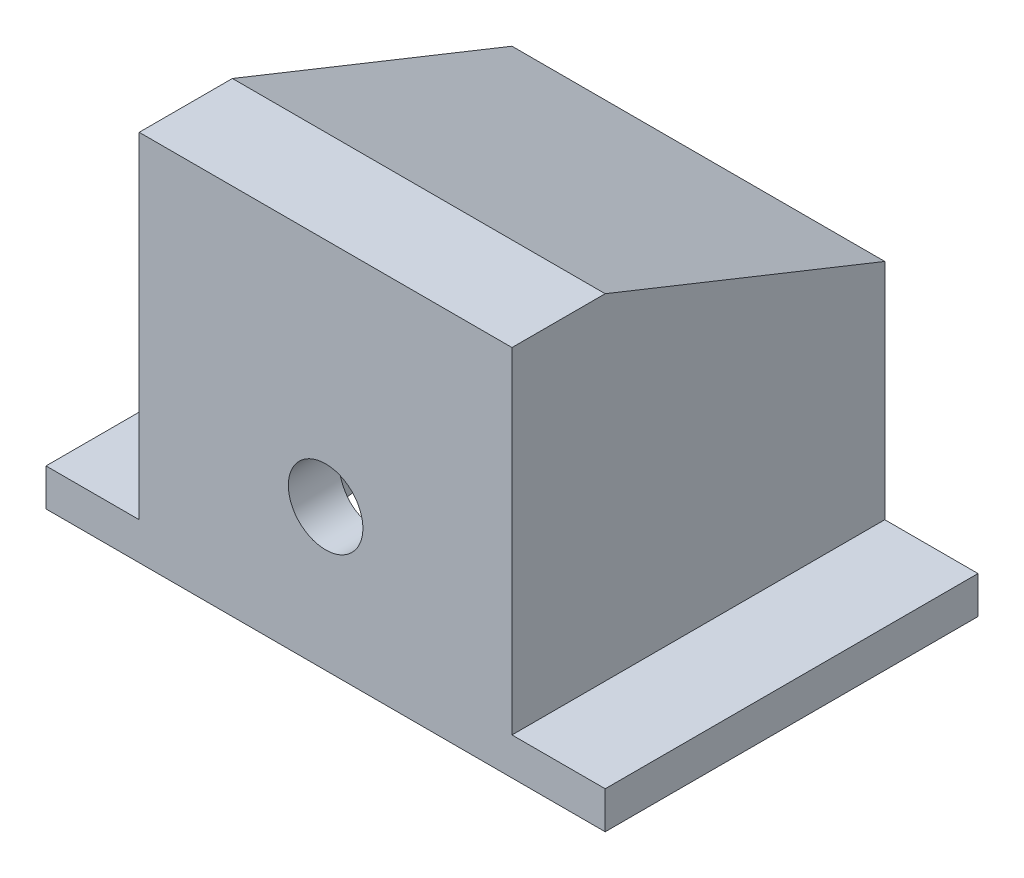
ISO-10303-21;
HEADER;
FILE_DESCRIPTION(('STEP AP214'),'2;1');
FILE_NAME('part.step','',(''),(''),'','','');
FILE_SCHEMA(('AUTOMOTIVE_DESIGN { 1 0 10303 214 1 1 1 1 }'));
ENDSEC;
DATA;
#1=APPLICATION_CONTEXT('core data for automotive mechanical design processes');
#2=APPLICATION_PROTOCOL_DEFINITION('international standard','automotive_design',2000,#1);
#3=PRODUCT_CONTEXT('',#1,'mechanical');
#4=PRODUCT('Part','Part','',(#3));
#5=PRODUCT_RELATED_PRODUCT_CATEGORY('part','',(#4));
#6=PRODUCT_DEFINITION_FORMATION('','',#4);
#7=PRODUCT_DEFINITION_CONTEXT('part definition',#1,'design');
#8=PRODUCT_DEFINITION('design','',#6,#7);
#9=PRODUCT_DEFINITION_SHAPE('','',#8);
#10=(LENGTH_UNIT() NAMED_UNIT(*) SI_UNIT(.MILLI.,.METRE.));
#11=(NAMED_UNIT(*) PLANE_ANGLE_UNIT() SI_UNIT($,.RADIAN.));
#12=(NAMED_UNIT(*) SI_UNIT($,.STERADIAN.) SOLID_ANGLE_UNIT());
#13=UNCERTAINTY_MEASURE_WITH_UNIT(LENGTH_MEASURE(1.E-05),#10,'distance_accuracy_value','');
#14=(GEOMETRIC_REPRESENTATION_CONTEXT(3) GLOBAL_UNCERTAINTY_ASSIGNED_CONTEXT((#13)) GLOBAL_UNIT_ASSIGNED_CONTEXT((#10,
#11,#12)) REPRESENTATION_CONTEXT('',''));
#15=CARTESIAN_POINT('',(0.,0.,0.));
#16=DIRECTION('',(0.,0.,1.));
#17=DIRECTION('',(1.,0.,0.));
#18=AXIS2_PLACEMENT_3D('',#15,#16,#17);
#19=CARTESIAN_POINT('',(0.,20.,0.));
#20=DIRECTION('',(1.,0.,0.));
#21=DIRECTION('',(0.,0.,-1.));
#22=AXIS2_PLACEMENT_3D('',#19,#20,#21);
#23=PLANE('',#22);
#24=DIRECTION('',(0.,-1.,0.));
#25=VECTOR('',#24,1.);
#26=CARTESIAN_POINT('',(0.,20.,-20.));
#27=LINE('',#26,#25);
#28=CARTESIAN_POINT('',(0.,14.,-20.));
#29=VERTEX_POINT('',#28);
#30=CARTESIAN_POINT('',(0.,2.,-20.));
#31=VERTEX_POINT('',#30);
#32=EDGE_CURVE('E187',#29,#31,#27,.T.);
#33=ORIENTED_EDGE('',*,*,#32,.T.);
#34=DIRECTION('',(0.,0.,1.));
#35=VECTOR('',#34,1.);
#36=CARTESIAN_POINT('',(0.,2.,0.));
#37=LINE('',#36,#35);
#38=CARTESIAN_POINT('',(0.,2.,0.));
#39=VERTEX_POINT('',#38);
#40=EDGE_CURVE('E130',#31,#39,#37,.T.);
#41=ORIENTED_EDGE('',*,*,#40,.T.);
#42=DIRECTION('',(0.,-1.,0.));
#43=VECTOR('',#42,1.);
#44=CARTESIAN_POINT('',(0.,20.,0.));
#45=LINE('',#44,#43);
#46=CARTESIAN_POINT('',(0.,20.,0.));
#47=VERTEX_POINT('',#46);
#48=EDGE_CURVE('E140',#47,#39,#45,.T.);
#49=ORIENTED_EDGE('',*,*,#48,.F.);
#50=DIRECTION('',(0.,0.,1.));
#51=VECTOR('',#50,1.);
#52=CARTESIAN_POINT('',(0.,20.,0.));
#53=LINE('',#52,#51);
#54=CARTESIAN_POINT('',(0.,20.,-5.));
#55=VERTEX_POINT('',#54);
#56=EDGE_CURVE('E179',#55,#47,#53,.T.);
#57=ORIENTED_EDGE('',*,*,#56,.F.);
#58=DIRECTION('',(0.,0.371390676354104,0.928476690885259));
#59=VECTOR('',#58,1.);
#60=CARTESIAN_POINT('',(0.,20.,-5.));
#61=LINE('',#60,#59);
#62=EDGE_CURVE('E202',#55,#29,#61,.F.);
#63=ORIENTED_EDGE('',*,*,#62,.T.);
#64=EDGE_LOOP('',(#33,#41,#49,#57,#63));
#65=FACE_BOUND('',#64,.T.);
#66=ADVANCED_FACE('F41',(#65),#23,.F.);
#67=CARTESIAN_POINT('',(0.,20.,0.));
#68=DIRECTION('',(0.,0.,-1.));
#69=DIRECTION('',(-1.,0.,0.));
#70=AXIS2_PLACEMENT_3D('',#67,#68,#69);
#71=PLANE('',#70);
#72=CARTESIAN_POINT('',(10.,7.6,0.));
#73=DIRECTION('',(0.,0.,-1.));
#74=DIRECTION('',(-1.,0.,0.));
#75=AXIS2_PLACEMENT_3D('',#72,#73,#74);
#76=CIRCLE('',#75,2.);
#77=CARTESIAN_POINT('',(8.,7.6,0.));
#78=VERTEX_POINT('',#77);
#79=EDGE_CURVE('E168',#78,#78,#76,.F.);
#80=ORIENTED_EDGE('',*,*,#79,.F.);
#81=EDGE_LOOP('',(#80));
#82=FACE_BOUND('',#81,.T.);
#83=DIRECTION('',(1.,0.,0.));
#84=VECTOR('',#83,1.);
#85=CARTESIAN_POINT('',(0.,0.,0.));
#86=LINE('',#85,#84);
#87=CARTESIAN_POINT('',(-5.,0.,0.));
#88=VERTEX_POINT('',#87);
#89=CARTESIAN_POINT('',(25.,0.,0.));
#90=VERTEX_POINT('',#89);
#91=EDGE_CURVE('E175',#88,#90,#86,.T.);
#92=ORIENTED_EDGE('',*,*,#91,.T.);
#93=DIRECTION('',(0.,-1.,0.));
#94=VECTOR('',#93,1.);
#95=CARTESIAN_POINT('',(25.,2.,0.));
#96=LINE('',#95,#94);
#97=CARTESIAN_POINT('',(25.,2.,0.));
#98=VERTEX_POINT('',#97);
#99=EDGE_CURVE('E160',#98,#90,#96,.T.);
#100=ORIENTED_EDGE('',*,*,#99,.F.);
#101=DIRECTION('',(-1.,0.,0.));
#102=VECTOR('',#101,1.);
#103=CARTESIAN_POINT('',(20.,2.,0.));
#104=LINE('',#103,#102);
#105=CARTESIAN_POINT('',(20.,2.,0.));
#106=VERTEX_POINT('',#105);
#107=EDGE_CURVE('E154',#98,#106,#104,.T.);
#108=ORIENTED_EDGE('',*,*,#107,.T.);
#109=DIRECTION('',(0.,-1.,0.));
#110=VECTOR('',#109,1.);
#111=CARTESIAN_POINT('',(20.,20.,0.));
#112=LINE('',#111,#110);
#113=CARTESIAN_POINT('',(20.,20.,0.));
#114=VERTEX_POINT('',#113);
#115=EDGE_CURVE('E195',#114,#106,#112,.T.);
#116=ORIENTED_EDGE('',*,*,#115,.F.);
#117=DIRECTION('',(1.,0.,0.));
#118=VECTOR('',#117,1.);
#119=CARTESIAN_POINT('',(0.,20.,0.));
#120=LINE('',#119,#118);
#121=EDGE_CURVE('E181',#47,#114,#120,.T.);
#122=ORIENTED_EDGE('',*,*,#121,.F.);
#123=ORIENTED_EDGE('',*,*,#48,.T.);
#124=DIRECTION('',(-1.,0.,0.));
#125=VECTOR('',#124,1.);
#126=CARTESIAN_POINT('',(0.,2.,0.));
#127=LINE('',#126,#125);
#128=CARTESIAN_POINT('',(-5.,2.,0.));
#129=VERTEX_POINT('',#128);
#130=EDGE_CURVE('E63',#39,#129,#127,.T.);
#131=ORIENTED_EDGE('',*,*,#130,.T.);
#132=DIRECTION('',(0.,-1.,0.));
#133=VECTOR('',#132,1.);
#134=CARTESIAN_POINT('',(-5.,2.,0.));
#135=LINE('',#134,#133);
#136=EDGE_CURVE('E122',#129,#88,#135,.T.);
#137=ORIENTED_EDGE('',*,*,#136,.T.);
#138=EDGE_LOOP('',(#92,#100,#108,#116,#122,#123,#131,#137));
#139=FACE_BOUND('',#138,.T.);
#140=ADVANCED_FACE('F137',(#82,#139),#71,.F.);
#141=CARTESIAN_POINT('',(20.,20.,0.));
#142=DIRECTION('',(-1.,0.,0.));
#143=DIRECTION('',(0.,0.,1.));
#144=AXIS2_PLACEMENT_3D('',#141,#142,#143);
#145=PLANE('',#144);
#146=ORIENTED_EDGE('',*,*,#115,.T.);
#147=DIRECTION('',(0.,0.,-1.));
#148=VECTOR('',#147,1.);
#149=CARTESIAN_POINT('',(20.,2.,0.));
#150=LINE('',#149,#148);
#151=CARTESIAN_POINT('',(20.,2.,-20.));
#152=VERTEX_POINT('',#151);
#153=EDGE_CURVE('E148',#106,#152,#150,.T.);
#154=ORIENTED_EDGE('',*,*,#153,.T.);
#155=DIRECTION('',(0.,-1.,0.));
#156=VECTOR('',#155,1.);
#157=CARTESIAN_POINT('',(20.,20.,-20.));
#158=LINE('',#157,#156);
#159=CARTESIAN_POINT('',(20.,14.,-20.));
#160=VERTEX_POINT('',#159);
#161=EDGE_CURVE('E192',#160,#152,#158,.T.);
#162=ORIENTED_EDGE('',*,*,#161,.F.);
#163=DIRECTION('',(0.,-0.371390676354104,-0.928476690885259));
#164=VECTOR('',#163,1.);
#165=CARTESIAN_POINT('',(20.,20.,-5.));
#166=LINE('',#165,#164);
#167=CARTESIAN_POINT('',(20.,20.,-5.));
#168=VERTEX_POINT('',#167);
#169=EDGE_CURVE('E13',#160,#168,#166,.F.);
#170=ORIENTED_EDGE('',*,*,#169,.T.);
#171=DIRECTION('',(0.,0.,-1.));
#172=VECTOR('',#171,1.);
#173=CARTESIAN_POINT('',(20.,20.,0.));
#174=LINE('',#173,#172);
#175=EDGE_CURVE('E184',#114,#168,#174,.T.);
#176=ORIENTED_EDGE('',*,*,#175,.F.);
#177=EDGE_LOOP('',(#146,#154,#162,#170,#176));
#178=FACE_BOUND('',#177,.T.);
#179=ADVANCED_FACE('F235',(#178),#145,.F.);
#180=CARTESIAN_POINT('',(0.,20.,-20.));
#181=DIRECTION('',(0.,0.,1.));
#182=DIRECTION('',(1.,0.,0.));
#183=AXIS2_PLACEMENT_3D('',#180,#181,#182);
#184=PLANE('',#183);
#185=CARTESIAN_POINT('',(10.,7.6,-20.));
#186=DIRECTION('',(0.,0.,-1.));
#187=DIRECTION('',(-1.,0.,0.));
#188=AXIS2_PLACEMENT_3D('',#185,#186,#187);
#189=CIRCLE('',#188,2.);
#190=CARTESIAN_POINT('',(8.,7.6,-20.));
#191=VERTEX_POINT('',#190);
#192=EDGE_CURVE('E163',#191,#191,#189,.T.);
#193=ORIENTED_EDGE('',*,*,#192,.F.);
#194=EDGE_LOOP('',(#193));
#195=FACE_BOUND('',#194,.T.);
#196=ORIENTED_EDGE('',*,*,#32,.F.);
#197=DIRECTION('',(1.,0.,0.));
#198=VECTOR('',#197,1.);
#199=CARTESIAN_POINT('',(0.,14.,-20.));
#200=LINE('',#199,#198);
#201=EDGE_CURVE('E55',#29,#160,#200,.T.);
#202=ORIENTED_EDGE('',*,*,#201,.T.);
#203=ORIENTED_EDGE('',*,*,#161,.T.);
#204=DIRECTION('',(1.,0.,0.));
#205=VECTOR('',#204,1.);
#206=CARTESIAN_POINT('',(20.,2.,-20.));
#207=LINE('',#206,#205);
#208=CARTESIAN_POINT('',(25.,2.,-20.));
#209=VERTEX_POINT('',#208);
#210=EDGE_CURVE('E71',#152,#209,#207,.T.);
#211=ORIENTED_EDGE('',*,*,#210,.T.);
#212=DIRECTION('',(0.,-1.,0.));
#213=VECTOR('',#212,1.);
#214=CARTESIAN_POINT('',(25.,2.,-20.));
#215=LINE('',#214,#213);
#216=CARTESIAN_POINT('',(25.,0.,-20.));
#217=VERTEX_POINT('',#216);
#218=EDGE_CURVE('E157',#209,#217,#215,.T.);
#219=ORIENTED_EDGE('',*,*,#218,.T.);
#220=DIRECTION('',(-1.,0.,0.));
#221=VECTOR('',#220,1.);
#222=CARTESIAN_POINT('',(0.,0.,-20.));
#223=LINE('',#222,#221);
#224=CARTESIAN_POINT('',(-5.,0.,-20.));
#225=VERTEX_POINT('',#224);
#226=EDGE_CURVE('E182',#217,#225,#223,.T.);
#227=ORIENTED_EDGE('',*,*,#226,.T.);
#228=DIRECTION('',(0.,-1.,0.));
#229=VECTOR('',#228,1.);
#230=CARTESIAN_POINT('',(-5.,2.,-20.));
#231=LINE('',#230,#229);
#232=CARTESIAN_POINT('',(-5.,2.,-20.));
#233=VERTEX_POINT('',#232);
#234=EDGE_CURVE('E129',#233,#225,#231,.T.);
#235=ORIENTED_EDGE('',*,*,#234,.F.);
#236=DIRECTION('',(1.,0.,0.));
#237=VECTOR('',#236,1.);
#238=CARTESIAN_POINT('',(0.,2.,-20.));
#239=LINE('',#238,#237);
#240=EDGE_CURVE('E134',#233,#31,#239,.T.);
#241=ORIENTED_EDGE('',*,*,#240,.T.);
#242=EDGE_LOOP('',(#196,#202,#203,#211,#219,#227,#235,#241));
#243=FACE_BOUND('',#242,.T.);
#244=ADVANCED_FACE('F241',(#195,#243),#184,.F.);
#245=CARTESIAN_POINT('',(0.,20.,0.));
#246=DIRECTION('',(0.,-1.,0.));
#247=DIRECTION('',(0.,0.,-1.));
#248=AXIS2_PLACEMENT_3D('',#245,#246,#247);
#249=PLANE('',#248);
#250=ORIENTED_EDGE('',*,*,#175,.T.);
#251=DIRECTION('',(-1.,0.,0.));
#252=VECTOR('',#251,1.);
#253=CARTESIAN_POINT('',(0.,20.,-5.));
#254=LINE('',#253,#252);
#255=EDGE_CURVE('E199',#168,#55,#254,.T.);
#256=ORIENTED_EDGE('',*,*,#255,.T.);
#257=ORIENTED_EDGE('',*,*,#56,.T.);
#258=ORIENTED_EDGE('',*,*,#121,.T.);
#259=EDGE_LOOP('',(#250,#256,#257,#258));
#260=FACE_BOUND('',#259,.T.);
#261=ADVANCED_FACE('F245',(#260),#249,.F.);
#262=CARTESIAN_POINT('',(0.,0.,0.));
#263=DIRECTION('',(0.,-1.,0.));
#264=DIRECTION('',(0.,0.,-1.));
#265=AXIS2_PLACEMENT_3D('',#262,#263,#264);
#266=PLANE('',#265);
#267=CARTESIAN_POINT('',(10.,0.,-10.));
#268=DIRECTION('',(0.,-1.,0.));
#269=DIRECTION('',(0.,0.,-1.));
#270=AXIS2_PLACEMENT_3D('',#267,#268,#269);
#271=CIRCLE('',#270,7.6);
#272=CARTESIAN_POINT('',(10.,0.,-17.6));
#273=VERTEX_POINT('',#272);
#274=EDGE_CURVE('E176',#273,#273,#271,.T.);
#275=ORIENTED_EDGE('',*,*,#274,.F.);
#276=EDGE_LOOP('',(#275));
#277=FACE_BOUND('',#276,.T.);
#278=ORIENTED_EDGE('',*,*,#91,.F.);
#279=DIRECTION('',(0.,0.,-1.));
#280=VECTOR('',#279,1.);
#281=CARTESIAN_POINT('',(-5.,0.,0.));
#282=LINE('',#281,#280);
#283=EDGE_CURVE('E127',#88,#225,#282,.T.);
#284=ORIENTED_EDGE('',*,*,#283,.T.);
#285=ORIENTED_EDGE('',*,*,#226,.F.);
#286=DIRECTION('',(0.,0.,1.));
#287=VECTOR('',#286,1.);
#288=CARTESIAN_POINT('',(25.,0.,0.));
#289=LINE('',#288,#287);
#290=EDGE_CURVE('E146',#217,#90,#289,.T.);
#291=ORIENTED_EDGE('',*,*,#290,.T.);
#292=EDGE_LOOP('',(#278,#284,#285,#291));
#293=FACE_BOUND('',#292,.T.);
#294=ADVANCED_FACE('F247',(#277,#293),#266,.T.);
#295=CARTESIAN_POINT('',(0.,20.,-5.));
#296=DIRECTION('',(0.,-0.928476690885259,0.371390676354104));
#297=DIRECTION('',(-1.,0.,0.));
#298=AXIS2_PLACEMENT_3D('',#295,#296,#297);
#299=PLANE('',#298);
#300=ORIENTED_EDGE('',*,*,#169,.F.);
#301=ORIENTED_EDGE('',*,*,#201,.F.);
#302=ORIENTED_EDGE('',*,*,#62,.F.);
#303=ORIENTED_EDGE('',*,*,#255,.F.);
#304=EDGE_LOOP('',(#300,#301,#302,#303));
#305=FACE_BOUND('',#304,.T.);
#306=ADVANCED_FACE('F43',(#305),#299,.F.);
#307=CARTESIAN_POINT('',(10.,13.,-10.));
#308=DIRECTION('',(0.,-1.,0.));
#309=DIRECTION('',(0.,0.,-1.));
#310=AXIS2_PLACEMENT_3D('',#307,#308,#309);
#311=CYLINDRICAL_SURFACE('',#310,7.6);
#312=CARTESIAN_POINT('',(10.,9.6,-17.6));
#313=CARTESIAN_POINT('',(10.1103077305601,9.59999727332697,-17.5999982871455));
#314=CARTESIAN_POINT('',(10.2206449359856,9.59084353481075,-17.5975747644297));
#315=CARTESIAN_POINT('',(10.4381443376833,9.55453308901949,-17.5881421009162));
#316=CARTESIAN_POINT('',(10.5453049197391,9.52736738732782,-17.5811306691326));
#317=CARTESIAN_POINT('',(10.7532798361747,9.45597473968142,-17.5632966106084));
#318=CARTESIAN_POINT('',(10.8541020443881,9.41176946848748,-17.5524788271606));
#319=CARTESIAN_POINT('',(11.0469012230525,9.30763198314898,-17.5281772122626));
#320=CARTESIAN_POINT('',(11.1388776652486,9.24769883055689,-17.5146932217377));
#321=CARTESIAN_POINT('',(11.3134559490354,9.11237470744187,-17.4861755330928));
#322=CARTESIAN_POINT('',(11.3958290770572,9.03669413794758,-17.4711158938237));
#323=CARTESIAN_POINT('',(11.5468726766925,8.87264275306714,-17.4413120236605));
#324=CARTESIAN_POINT('',(11.6155414326768,8.78427035118859,-17.4265678324628));
#325=CARTESIAN_POINT('',(11.7383336680974,8.59552898529889,-17.3987997288807));
#326=CARTESIAN_POINT('',(11.7921955989454,8.49498459816491,-17.3858085903369));
#327=CARTESIAN_POINT('',(11.8821611802115,8.28587031662129,-17.3633982451214));
#328=CARTESIAN_POINT('',(11.9182680102081,8.17730186316783,-17.3539783989728));
#329=CARTESIAN_POINT('',(11.9709071610783,7.95775045751483,-17.3400447576793));
#330=CARTESIAN_POINT('',(11.9878534209387,7.84687348172334,-17.3354273949558));
#331=CARTESIAN_POINT('',(12.0029806593874,7.62376159546161,-17.3313119612008));
#332=CARTESIAN_POINT('',(12.0011650453797,7.51152693526287,-17.3318129606069));
#333=CARTESIAN_POINT('',(11.979149052759,7.29210381644217,-17.3377848618719));
#334=CARTESIAN_POINT('',(11.9594478952481,7.18486101301021,-17.343120803201));
#335=CARTESIAN_POINT('',(11.9030189360574,6.97525919705931,-17.3579454846944));
#336=CARTESIAN_POINT('',(11.8662898053087,6.8729005664482,-17.3674345490155));
#337=CARTESIAN_POINT('',(11.7764367186874,6.67466337033174,-17.3896160870518));
#338=CARTESIAN_POINT('',(11.7231364253582,6.57886871674745,-17.4023427343597));
#339=CARTESIAN_POINT('',(11.6017770961602,6.39740691268406,-17.4295468982524));
#340=CARTESIAN_POINT('',(11.5337152239016,6.31174171344167,-17.4440247510888));
#341=CARTESIAN_POINT('',(11.3822050171688,6.15011640603572,-17.4736632108534));
#342=CARTESIAN_POINT('',(11.2983370128123,6.07455046241615,-17.488830905761));
#343=CARTESIAN_POINT('',(11.1189344723606,5.93847627648179,-17.5177276126972));
#344=CARTESIAN_POINT('',(11.023399500154,5.87796859730194,-17.5314565709102));
#345=CARTESIAN_POINT('',(10.8227748702699,5.77356125603069,-17.5560097590161));
#346=CARTESIAN_POINT('',(10.7176473149743,5.72973134653084,-17.5668217353776));
#347=CARTESIAN_POINT('',(10.5011668202814,5.66047966896322,-17.5842340731603));
#348=CARTESIAN_POINT('',(10.3898152099559,5.63505398694887,-17.5908353300215));
#349=CARTESIAN_POINT('',(10.167412666022,5.6039477434924,-17.5989476543889));
#350=CARTESIAN_POINT('',(10.0564416383871,5.59773109839775,-17.6005968844482));
#351=CARTESIAN_POINT('',(9.83504313014607,5.60374111690053,-17.5990157568394));
#352=CARTESIAN_POINT('',(9.72461559605388,5.61596592770282,-17.5957858893694));
#353=CARTESIAN_POINT('',(9.50934118766853,5.65807163649291,-17.5848985710053));
#354=CARTESIAN_POINT('',(9.40443198357834,5.68765493602793,-17.5773157939217));
#355=CARTESIAN_POINT('',(9.20107443639967,5.76329349643487,-17.5585815253349));
#356=CARTESIAN_POINT('',(9.10262678520823,5.80935051790303,-17.5474296524051));
#357=CARTESIAN_POINT('',(8.912893115047,5.91763305770661,-17.5224689005433));
#358=CARTESIAN_POINT('',(8.82178092074553,5.98015207165798,-17.5086131120961));
#359=CARTESIAN_POINT('',(8.65115221935879,6.11921362431206,-17.4798468852588));
#360=CARTESIAN_POINT('',(8.5716379458241,6.19575885782469,-17.464936244542));
#361=CARTESIAN_POINT('',(8.42421384894535,6.36319920856277,-17.4352348380538));
#362=CARTESIAN_POINT('',(8.3566818175648,6.45443013067817,-17.4204585590288));
#363=CARTESIAN_POINT('',(8.2378793817264,6.64724039689845,-17.3931495963007));
#364=CARTESIAN_POINT('',(8.18660828587872,6.74881930078045,-17.3806168172174));
#365=CARTESIAN_POINT('',(8.1021690878029,6.95892498766296,-17.3593569458031));
#366=CARTESIAN_POINT('',(8.06889532457678,7.06740694497724,-17.3506077028033));
#367=CARTESIAN_POINT('',(8.02113851566438,7.28869458185313,-17.3378968052726));
#368=CARTESIAN_POINT('',(8.00665082029314,7.40149918441032,-17.3339339660894));
#369=CARTESIAN_POINT('',(7.99713967530735,7.6243673421597,-17.3313416819152));
#370=CARTESIAN_POINT('',(8.00150977037439,7.73440347625629,-17.33254605516));
#371=CARTESIAN_POINT('',(8.02818743953568,7.95211040335236,-17.3397644582545));
#372=CARTESIAN_POINT('',(8.05049457470362,8.05978125416501,-17.3457783704129));
#373=CARTESIAN_POINT('',(8.11206579077547,8.26896036119323,-17.3618406508767));
#374=CARTESIAN_POINT('',(8.15120454203399,8.3705079608682,-17.3718591624495));
#375=CARTESIAN_POINT('',(8.24523035269886,8.56567133098789,-17.3948032410771));
#376=CARTESIAN_POINT('',(8.30011982271296,8.65928588445697,-17.4077292530521));
#377=CARTESIAN_POINT('',(8.42594055277581,8.83882833006595,-17.4354955313453));
#378=CARTESIAN_POINT('',(8.4972871696406,8.92445833405862,-17.4503801051353));
#379=CARTESIAN_POINT('',(8.65320278090077,9.08272753068858,-17.4801353739938));
#380=CARTESIAN_POINT('',(8.73777496814073,9.15536357729418,-17.4950060648363));
#381=CARTESIAN_POINT('',(8.91985033095893,9.28705619708457,-17.5234254065456));
#382=CARTESIAN_POINT('',(9.01758463455323,9.34580108779218,-17.5369403819044));
#383=CARTESIAN_POINT('',(9.22189289666711,9.44593396047491,-17.5607601280525));
#384=CARTESIAN_POINT('',(9.32846098318305,9.48733336328497,-17.5710670100019));
#385=CARTESIAN_POINT('',(9.52889936277852,9.5460384721217,-17.5859349673448));
#386=CARTESIAN_POINT('',(9.62188531840802,9.56622776042776,-17.5911714000355));
#387=CARTESIAN_POINT('',(9.80990701464762,9.59320907422099,-17.5982044939182));
#388=CARTESIAN_POINT('',(9.90494256317135,9.6000023497043,-17.6000014760485));
#389=CARTESIAN_POINT('',(10.,9.6,-17.6));
#390=B_SPLINE_CURVE_WITH_KNOTS('',3,(#312,#313,#314,#315,#316,#317,#318,#319,#320,#321,#322,
#323,#324,#325,#326,#327,#328,#329,#330,#331,#332,#333,#334,#335,#336,#337,#338,#339,#340,#341,
#342,#343,#344,#345,#346,#347,#348,#349,#350,#351,#352,#353,#354,#355,#356,#357,#358,#359,#360,
#361,#362,#363,#364,#365,#366,#367,#368,#369,#370,#371,#372,#373,#374,#375,#376,#377,#378,#379,
#380,#381,#382,#383,#384,#385,#386,#387,#388,#389),.UNSPECIFIED.,.T.,.F.,(4,2,2,2,2,2,2,2,2,2,2,
2,2,2,2,2,2,2,2,2,2,2,2,2,2,2,2,2,2,2,2,2,2,2,2,2,2,2,4),(0.,0.330574645834024,
0.661314491187416,0.991635008125812,1.32197523903445,1.65903413949998,1.99613520941282,
2.33885568494099,2.68151476381289,3.01662056728243,3.3516655121819,3.67763689182931,
4.00363371850887,4.33322568429278,4.66288103630069,5.00299580592632,5.34312329293655,
5.68465807920425,6.02612021140573,6.35796260710344,6.68977166513867,7.01605177441632,
7.34236676465521,7.67494788505055,8.00759297025066,8.34935532098777,8.69110313856946,
9.0308221805077,9.37045712351516,9.69925242300548,10.0280396769924,10.3544200269369,
10.6808503552366,11.0166535224827,11.3525378829913,11.6953641850873,12.0379644030747,
12.3228629404097,12.6077348923025),.UNSPECIFIED.);
#391=CARTESIAN_POINT('',(10.,9.6,-17.6));
#392=VERTEX_POINT('',#391);
#393=EDGE_CURVE('E45',#392,#392,#390,.T.);
#394=ORIENTED_EDGE('',*,*,#393,.T.);
#395=EDGE_LOOP('',(#394));
#396=FACE_BOUND('',#395,.T.);
#397=CARTESIAN_POINT('',(8.,7.6,-2.66787888807065));
#398=CARTESIAN_POINT('',(8.00000276599729,7.48976686204482,-2.66787692776189));
#399=CARTESIAN_POINT('',(8.00914455595565,7.37950417209052,-2.66536580545032));
#400=CARTESIAN_POINT('',(8.04540324746967,7.16215930576434,-2.6556217293923));
#401=CARTESIAN_POINT('',(8.07252947544504,7.05507880974266,-2.64838632574446));
#402=CARTESIAN_POINT('',(8.14380678376653,6.84727381231109,-2.63006862192469));
#403=CARTESIAN_POINT('',(8.1879343504549,6.74654075500005,-2.61899163694538));
#404=CARTESIAN_POINT('',(8.2918884823279,6.55389279127753,-2.59424561011684));
#405=CARTESIAN_POINT('',(8.35171614954339,6.46197850449718,-2.58057638633033));
#406=CARTESIAN_POINT('',(8.48693045113749,6.28733783214917,-2.55181296474619));
#407=CARTESIAN_POINT('',(8.56263044565936,6.20485808683986,-2.53669403218509));
#408=CARTESIAN_POINT('',(8.72676640325725,6.05360650496584,-2.50694843807968));
#409=CARTESIAN_POINT('',(8.81520365644608,5.98483605865276,-2.49232182658622));
#410=CARTESIAN_POINT('',(9.00400952223337,5.8619309121777,-2.46493339197412));
#411=CARTESIAN_POINT('',(9.10454247981947,5.80804078622589,-2.45220415278088));
#412=CARTESIAN_POINT('',(9.31363238438037,5.71802001427478,-2.43032816085392));
#413=CARTESIAN_POINT('',(9.42218801164357,5.68188645480651,-2.42118082045807));
#414=CARTESIAN_POINT('',(9.64166801271143,5.62920097720801,-2.40767417353015));
#415=CARTESIAN_POINT('',(9.75248529948121,5.61222965906612,-2.40321247252726));
#416=CARTESIAN_POINT('',(9.97547792627989,5.59703156285508,-2.39922206466823));
#417=CARTESIAN_POINT('',(10.0876530417424,5.59880172639036,-2.39969255293506));
#418=CARTESIAN_POINT('',(10.3072601393456,5.62073964414333,-2.40543823016989));
#419=CARTESIAN_POINT('',(10.4147409445107,5.64045436494663,-2.4105951003331));
#420=CARTESIAN_POINT('',(10.6248114429376,5.69699067311018,-2.42499489347467));
#421=CARTESIAN_POINT('',(10.7274008606872,5.7338132228334,-2.43423804631638));
#422=CARTESIAN_POINT('',(10.9259409258729,5.82387129175163,-2.45594851775222));
#423=CARTESIAN_POINT('',(11.0218171019436,5.87726332051096,-2.46844639009594));
#424=CARTESIAN_POINT('',(11.2034043819033,5.99882492529181,-2.49531773271394));
#425=CARTESIAN_POINT('',(11.2891135447329,6.06699731613852,-2.50969156004399));
#426=CARTESIAN_POINT('',(11.4506374841107,6.21859453806116,-2.53926263265086));
#427=CARTESIAN_POINT('',(11.5260795243472,6.30241467064548,-2.55447164712643));
#428=CARTESIAN_POINT('',(11.6619254149039,6.48167462998135,-2.58360975157042));
#429=CARTESIAN_POINT('',(11.7223283971044,6.57711512703752,-2.59753876762252));
#430=CARTESIAN_POINT('',(11.8266554588071,6.77769816608451,-2.62258593353632));
#431=CARTESIAN_POINT('',(11.8704807429159,6.88289436197515,-2.63368710661588));
#432=CARTESIAN_POINT('',(11.9397030057677,7.09952615203017,-2.65160936818695));
#433=CARTESIAN_POINT('',(11.965104417616,7.21096023829335,-2.65843148624033));
#434=CARTESIAN_POINT('',(11.9961205368333,7.43342496872965,-2.66680456460017));
#435=CARTESIAN_POINT('',(12.0022902019366,7.54437276523676,-2.66850331820773));
#436=CARTESIAN_POINT('',(11.9961946164774,7.76571427955043,-2.66684124237453));
#437=CARTESIAN_POINT('',(11.9839312698173,7.87610805339907,-2.66348093547214));
#438=CARTESIAN_POINT('',(11.9418064548735,8.0910864220551,-2.65222187695906));
#439=CARTESIAN_POINT('',(11.9122763163379,8.19574085330529,-2.64440864149123));
#440=CARTESIAN_POINT('',(11.8368275902683,8.39861200679714,-2.62520711674869));
#441=CARTESIAN_POINT('',(11.7909069043202,8.49682790283313,-2.61381836973852));
#442=CARTESIAN_POINT('',(11.6828464547579,8.68636220523739,-2.58844401610081));
#443=CARTESIAN_POINT('',(11.6203795301077,8.77748716683072,-2.57440788911856));
#444=CARTESIAN_POINT('',(11.481407091613,8.94816517560008,-2.54544023827923));
#445=CARTESIAN_POINT('',(11.404899010369,9.02771610170838,-2.53050855100728));
#446=CARTESIAN_POINT('',(11.237453414162,9.1752795702748,-2.50092510448349));
#447=CARTESIAN_POINT('',(11.1461712877549,9.24290577142079,-2.48629295240131));
#448=CARTESIAN_POINT('',(10.9532275957223,9.36187385850744,-2.45938792210943));
#449=CARTESIAN_POINT('',(10.8515665819947,9.41321660972566,-2.44711491855187));
#450=CARTESIAN_POINT('',(10.6414653330975,9.49769385577293,-2.42638989887434));
#451=CARTESIAN_POINT('',(10.5330823442985,9.53096345858921,-2.41790961662105));
#452=CARTESIAN_POINT('',(10.3120082493634,9.57874521229605,-2.4056012671082));
#453=CARTESIAN_POINT('',(10.1993180765336,9.59326140332881,-2.40177219782498));
#454=CARTESIAN_POINT('',(9.97644209026249,9.60287668580068,-2.39924364462909));
#455=CARTESIAN_POINT('',(9.86628210622963,9.59854321146786,-2.40039425146103));
#456=CARTESIAN_POINT('',(9.64831744930803,9.5718958585314,-2.4073581725923));
#457=CARTESIAN_POINT('',(9.54051269221903,9.5495826237949,-2.41317131992291));
#458=CARTESIAN_POINT('',(9.33098221809818,9.48792655926166,-2.42877878600088));
#459=CARTESIAN_POINT('',(9.22922132201749,9.44869618024169,-2.4385467904738));
#460=CARTESIAN_POINT('',(9.03366809158366,9.35442008374477,-2.46104106891793));
#461=CARTESIAN_POINT('',(8.9398768540588,9.29937219392802,-2.47376774918086));
#462=CARTESIAN_POINT('',(8.76027291813472,9.17334791536647,-2.50122992596765));
#463=CARTESIAN_POINT('',(8.67473225233634,9.10199339216637,-2.51600917273509));
#464=CARTESIAN_POINT('',(8.51664678628682,8.94610216396534,-2.54572960639806));
#465=CARTESIAN_POINT('',(8.44410538308487,8.86156202398013,-2.56067083454491));
#466=CARTESIAN_POINT('',(8.31255350925241,8.67953686352619,-2.58938839298165));
#467=CARTESIAN_POINT('',(8.2538634644355,8.58181486266655,-2.60313320750322));
#468=CARTESIAN_POINT('',(8.15383003485241,8.37754127679878,-2.62746145650221));
#469=CARTESIAN_POINT('',(8.11247502460715,8.27099566682022,-2.63804700831493));
#470=CARTESIAN_POINT('',(8.05386082277979,8.0706640927411,-2.65334826327212));
#471=CARTESIAN_POINT('',(8.03370968835963,7.97776684445389,-2.6587538384778));
#472=CARTESIAN_POINT('',(8.00677880290714,7.78992022835784,-2.6660198051062));
#473=CARTESIAN_POINT('',(7.99999761696201,7.69497108187227,-2.66788057696972));
#474=CARTESIAN_POINT('',(8.,7.6,-2.66787888807065));
#475=B_SPLINE_CURVE_WITH_KNOTS('',3,(#397,#398,#399,#400,#401,#402,#403,#404,#405,#406,#407,
#408,#409,#410,#411,#412,#413,#414,#415,#416,#417,#418,#419,#420,#421,#422,#423,#424,#425,#426,
#427,#428,#429,#430,#431,#432,#433,#434,#435,#436,#437,#438,#439,#440,#441,#442,#443,#444,#445,
#446,#447,#448,#449,#450,#451,#452,#453,#454,#455,#456,#457,#458,#459,#460,#461,#462,#463,#464,
#465,#466,#467,#468,#469,#470,#471,#472,#473,#474),.UNSPECIFIED.,.T.,.F.,(4,2,2,2,2,2,2,2,2,2,2,
2,2,2,2,2,2,2,2,2,2,2,2,2,2,2,2,2,2,2,2,2,2,2,2,2,2,2,4),(0.,0.330350291685534,
0.660872031480874,0.990938275561917,1.32102769404999,1.65837957658723,1.99576565238902,
2.33840531149922,2.68098873205666,3.01591922945471,3.35079507086677,3.67744417248705,
4.00411165125322,4.33396379567162,4.66387881358162,5.00366420548206,5.34346920672635,
5.68526852595379,6.02698557499102,6.35874606235034,6.69047228530582,7.01603277243981,
7.34163495469677,7.67423021730903,8.00688635504818,8.3488755510372,8.69084657119868,
9.03022467852338,9.36952965970964,9.69869233828186,10.0278432298441,10.3548391400956,
10.6818799806801,11.0174540773321,11.3531157408405,11.6959129727781,12.0384799436987,
12.3231229545963,12.6077354148798),.UNSPECIFIED.);
#476=CARTESIAN_POINT('',(8.,7.6,-2.66787888807065));
#477=VERTEX_POINT('',#476);
#478=EDGE_CURVE('E171',#477,#477,#475,.T.);
#479=ORIENTED_EDGE('',*,*,#478,.T.);
#480=EDGE_LOOP('',(#479));
#481=FACE_BOUND('',#480,.T.);
#482=CARTESIAN_POINT('',(10.,13.,-10.));
#483=DIRECTION('',(0.,-1.,0.));
#484=DIRECTION('',(0.,0.,-1.));
#485=AXIS2_PLACEMENT_3D('',#482,#483,#484);
#486=CIRCLE('',#485,7.6);
#487=CARTESIAN_POINT('',(10.,13.,-17.6));
#488=VERTEX_POINT('',#487);
#489=EDGE_CURVE('E172',#488,#488,#486,.T.);
#490=ORIENTED_EDGE('',*,*,#489,.F.);
#491=EDGE_LOOP('',(#490));
#492=FACE_BOUND('',#491,.T.);
#493=ORIENTED_EDGE('',*,*,#274,.T.);
#494=EDGE_LOOP('',(#493));
#495=FACE_BOUND('',#494,.T.);
#496=ADVANCED_FACE('F208',(#396,#481,#492,#495),#311,.F.);
#497=CARTESIAN_POINT('',(10.,13.,-10.));
#498=DIRECTION('',(0.,-1.,0.));
#499=DIRECTION('',(0.,0.,-1.));
#500=AXIS2_PLACEMENT_3D('',#497,#498,#499);
#501=PLANE('',#500);
#502=ORIENTED_EDGE('',*,*,#489,.T.);
#503=EDGE_LOOP('',(#502));
#504=FACE_BOUND('',#503,.T.);
#505=ADVANCED_FACE('F220',(#504),#501,.T.);
#506=CARTESIAN_POINT('',(10.,7.6,5.65685424949238));
#507=DIRECTION('',(0.,0.,-1.));
#508=DIRECTION('',(-1.,0.,0.));
#509=AXIS2_PLACEMENT_3D('',#506,#507,#508);
#510=CYLINDRICAL_SURFACE('',#509,2.);
#511=ORIENTED_EDGE('',*,*,#79,.T.);
#512=EDGE_LOOP('',(#511));
#513=FACE_BOUND('',#512,.T.);
#514=ORIENTED_EDGE('',*,*,#478,.F.);
#515=EDGE_LOOP('',(#514));
#516=FACE_BOUND('',#515,.T.);
#517=ADVANCED_FACE('F217',(#513,#516),#510,.F.);
#518=ORIENTED_EDGE('',*,*,#192,.T.);
#519=EDGE_LOOP('',(#518));
#520=FACE_BOUND('',#519,.T.);
#521=ORIENTED_EDGE('',*,*,#393,.F.);
#522=EDGE_LOOP('',(#521));
#523=FACE_BOUND('',#522,.T.);
#524=ADVANCED_FACE('F212',(#520,#523),#510,.F.);
#525=CARTESIAN_POINT('',(25.,2.,0.));
#526=DIRECTION('',(1.,0.,0.));
#527=DIRECTION('',(0.,0.,-1.));
#528=AXIS2_PLACEMENT_3D('',#525,#526,#527);
#529=PLANE('',#528);
#530=ORIENTED_EDGE('',*,*,#290,.F.);
#531=ORIENTED_EDGE('',*,*,#218,.F.);
#532=DIRECTION('',(0.,0.,1.));
#533=VECTOR('',#532,1.);
#534=CARTESIAN_POINT('',(25.,2.,0.));
#535=LINE('',#534,#533);
#536=EDGE_CURVE('E151',#209,#98,#535,.T.);
#537=ORIENTED_EDGE('',*,*,#536,.T.);
#538=ORIENTED_EDGE('',*,*,#99,.T.);
#539=EDGE_LOOP('',(#530,#531,#537,#538));
#540=FACE_BOUND('',#539,.T.);
#541=ADVANCED_FACE('F216',(#540),#529,.T.);
#542=CARTESIAN_POINT('',(0.,2.,0.));
#543=DIRECTION('',(0.,-1.,0.));
#544=DIRECTION('',(0.,0.,-1.));
#545=AXIS2_PLACEMENT_3D('',#542,#543,#544);
#546=PLANE('',#545);
#547=ORIENTED_EDGE('',*,*,#153,.F.);
#548=ORIENTED_EDGE('',*,*,#107,.F.);
#549=ORIENTED_EDGE('',*,*,#536,.F.);
#550=ORIENTED_EDGE('',*,*,#210,.F.);
#551=EDGE_LOOP('',(#547,#548,#549,#550));
#552=FACE_BOUND('',#551,.T.);
#553=ADVANCED_FACE('F268',(#552),#546,.F.);
#554=CARTESIAN_POINT('',(-5.,2.,0.));
#555=DIRECTION('',(-1.,0.,0.));
#556=DIRECTION('',(0.,0.,1.));
#557=AXIS2_PLACEMENT_3D('',#554,#555,#556);
#558=PLANE('',#557);
#559=ORIENTED_EDGE('',*,*,#283,.F.);
#560=ORIENTED_EDGE('',*,*,#136,.F.);
#561=DIRECTION('',(0.,0.,-1.));
#562=VECTOR('',#561,1.);
#563=CARTESIAN_POINT('',(-5.,2.,0.));
#564=LINE('',#563,#562);
#565=EDGE_CURVE('E125',#129,#233,#564,.T.);
#566=ORIENTED_EDGE('',*,*,#565,.T.);
#567=ORIENTED_EDGE('',*,*,#234,.T.);
#568=EDGE_LOOP('',(#559,#560,#566,#567));
#569=FACE_BOUND('',#568,.T.);
#570=ADVANCED_FACE('F123',(#569),#558,.T.);
#571=CARTESIAN_POINT('',(0.,2.,0.));
#572=DIRECTION('',(0.,-1.,0.));
#573=DIRECTION('',(0.,0.,-1.));
#574=AXIS2_PLACEMENT_3D('',#571,#572,#573);
#575=PLANE('',#574);
#576=ORIENTED_EDGE('',*,*,#130,.F.);
#577=ORIENTED_EDGE('',*,*,#40,.F.);
#578=ORIENTED_EDGE('',*,*,#240,.F.);
#579=ORIENTED_EDGE('',*,*,#565,.F.);
#580=EDGE_LOOP('',(#576,#577,#578,#579));
#581=FACE_BOUND('',#580,.T.);
#582=ADVANCED_FACE('F133',(#581),#575,.F.);
#583=CLOSED_SHELL('',(#66,#140,#179,#244,#261,#294,#306,#496,#505,#517,#524,#541,#553,#570,#582));
#584=MANIFOLD_SOLID_BREP('B2',#583);
#585=ADVANCED_BREP_SHAPE_REPRESENTATION('',(#18,#584),#14);
#586=SHAPE_DEFINITION_REPRESENTATION(#9,#585);
ENDSEC;
END-ISO-10303-21;
